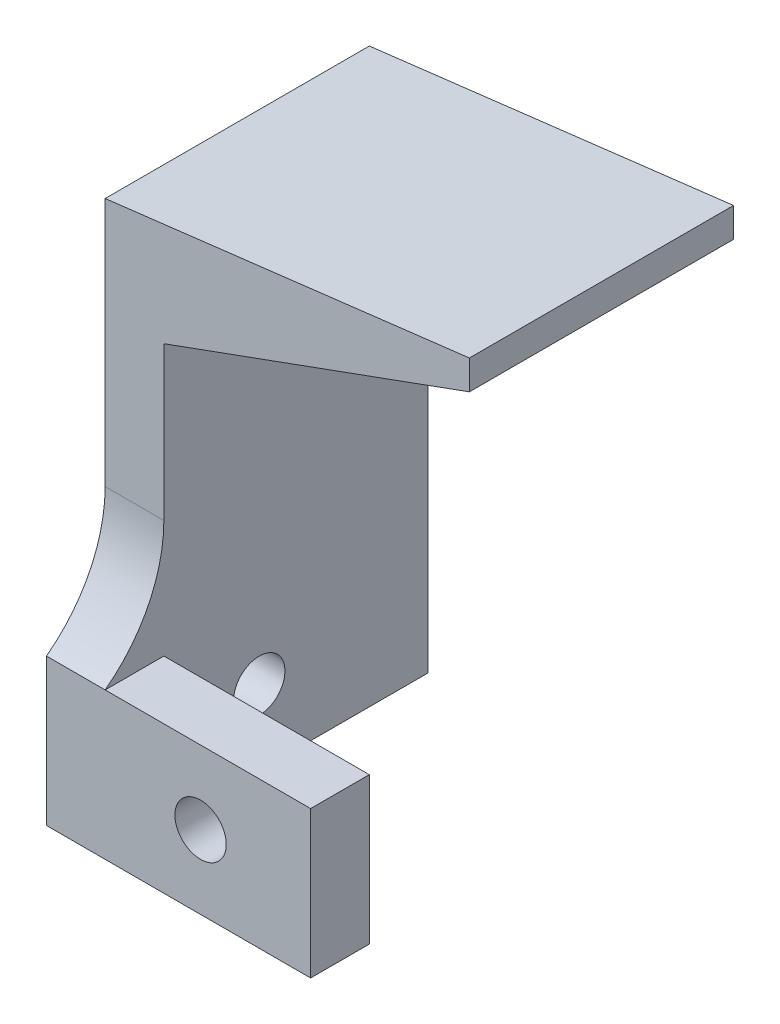
ISO-10303-21;
HEADER;
FILE_DESCRIPTION(('STEP AP214'),'2;1');
FILE_NAME('part.step','',(''),(''),'','','');
FILE_SCHEMA(('AUTOMOTIVE_DESIGN { 1 0 10303 214 1 1 1 1 }'));
ENDSEC;
DATA;
#1=APPLICATION_CONTEXT('core data for automotive mechanical design processes');
#2=APPLICATION_PROTOCOL_DEFINITION('international standard','automotive_design',2000,#1);
#3=PRODUCT_CONTEXT('',#1,'mechanical');
#4=PRODUCT('Part','Part','',(#3));
#5=PRODUCT_RELATED_PRODUCT_CATEGORY('part','',(#4));
#6=PRODUCT_DEFINITION_FORMATION('','',#4);
#7=PRODUCT_DEFINITION_CONTEXT('part definition',#1,'design');
#8=PRODUCT_DEFINITION('design','',#6,#7);
#9=PRODUCT_DEFINITION_SHAPE('','',#8);
#10=(LENGTH_UNIT() NAMED_UNIT(*) SI_UNIT(.MILLI.,.METRE.));
#11=(NAMED_UNIT(*) PLANE_ANGLE_UNIT() SI_UNIT($,.RADIAN.));
#12=(NAMED_UNIT(*) SI_UNIT($,.STERADIAN.) SOLID_ANGLE_UNIT());
#13=UNCERTAINTY_MEASURE_WITH_UNIT(LENGTH_MEASURE(1.E-05),#10,'distance_accuracy_value','');
#14=(GEOMETRIC_REPRESENTATION_CONTEXT(3) GLOBAL_UNCERTAINTY_ASSIGNED_CONTEXT((#13)) GLOBAL_UNIT_ASSIGNED_CONTEXT((#10,
#11,#12)) REPRESENTATION_CONTEXT('',''));
#15=CARTESIAN_POINT('',(0.,0.,0.));
#16=DIRECTION('',(0.,0.,1.));
#17=DIRECTION('',(1.,0.,0.));
#18=AXIS2_PLACEMENT_3D('',#15,#16,#17);
#19=CARTESIAN_POINT('',(0.,35.,18.));
#20=DIRECTION('',(1.,0.,0.));
#21=DIRECTION('',(0.,1.,0.));
#22=AXIS2_PLACEMENT_3D('',#19,#20,#21);
#23=PLANE('',#22);
#24=CARTESIAN_POINT('',(0.,5.,11.5));
#25=DIRECTION('',(-1.,0.,0.));
#26=DIRECTION('',(0.,-1.,0.));
#27=AXIS2_PLACEMENT_3D('',#24,#25,#26);
#28=CIRCLE('',#27,1.75);
#29=CARTESIAN_POINT('',(0.,3.25,11.5));
#30=VERTEX_POINT('',#29);
#31=EDGE_CURVE('E156',#30,#30,#28,.T.);
#32=ORIENTED_EDGE('',*,*,#31,.F.);
#33=EDGE_LOOP('',(#32));
#34=FACE_BOUND('',#33,.T.);
#35=DIRECTION('',(0.,-1.,0.));
#36=VECTOR('',#35,1.);
#37=CARTESIAN_POINT('',(0.,35.,0.));
#38=LINE('',#37,#36);
#39=CARTESIAN_POINT('',(0.,35.,0.));
#40=VERTEX_POINT('',#39);
#41=CARTESIAN_POINT('',(0.,0.,0.));
#42=VERTEX_POINT('',#41);
#43=EDGE_CURVE('E119',#40,#42,#38,.T.);
#44=ORIENTED_EDGE('',*,*,#43,.T.);
#45=DIRECTION('',(0.,0.,-1.));
#46=VECTOR('',#45,1.);
#47=CARTESIAN_POINT('',(0.,0.,18.));
#48=LINE('',#47,#46);
#49=CARTESIAN_POINT('',(0.,0.,22.));
#50=VERTEX_POINT('',#49);
#51=EDGE_CURVE('E113',#50,#42,#48,.T.);
#52=ORIENTED_EDGE('',*,*,#51,.F.);
#53=DIRECTION('',(0.,-1.,0.));
#54=VECTOR('',#53,1.);
#55=CARTESIAN_POINT('',(0.,0.,22.));
#56=LINE('',#55,#54);
#57=CARTESIAN_POINT('',(0.,10.,22.));
#58=VERTEX_POINT('',#57);
#59=EDGE_CURVE('E116',#58,#50,#56,.T.);
#60=ORIENTED_EDGE('',*,*,#59,.F.);
#61=CARTESIAN_POINT('',(0.,18.,28.));
#62=DIRECTION('',(1.,0.,0.));
#63=DIRECTION('',(0.,1.,0.));
#64=AXIS2_PLACEMENT_3D('',#61,#62,#63);
#65=CIRCLE('',#64,10.);
#66=CARTESIAN_POINT('',(0.,18.,18.));
#67=VERTEX_POINT('',#66);
#68=EDGE_CURVE('E42',#58,#67,#65,.T.);
#69=ORIENTED_EDGE('',*,*,#68,.T.);
#70=DIRECTION('',(0.,-1.,0.));
#71=VECTOR('',#70,1.);
#72=CARTESIAN_POINT('',(0.,35.,18.));
#73=LINE('',#72,#71);
#74=CARTESIAN_POINT('',(0.,35.,18.));
#75=VERTEX_POINT('',#74);
#76=EDGE_CURVE('E160',#75,#67,#73,.T.);
#77=ORIENTED_EDGE('',*,*,#76,.F.);
#78=DIRECTION('',(0.,0.,-1.));
#79=VECTOR('',#78,1.);
#80=CARTESIAN_POINT('',(0.,35.,18.));
#81=LINE('',#80,#79);
#82=EDGE_CURVE('E173',#75,#40,#81,.T.);
#83=ORIENTED_EDGE('',*,*,#82,.T.);
#84=EDGE_LOOP('',(#44,#52,#60,#69,#77,#83));
#85=FACE_BOUND('',#84,.T.);
#86=ADVANCED_FACE('F34',(#34,#85),#23,.F.);
#87=CARTESIAN_POINT('',(0.,0.,18.));
#88=DIRECTION('',(0.,1.,0.));
#89=DIRECTION('',(0.,0.,1.));
#90=AXIS2_PLACEMENT_3D('',#87,#88,#89);
#91=PLANE('',#90);
#92=DIRECTION('',(1.,0.,0.));
#93=VECTOR('',#92,1.);
#94=CARTESIAN_POINT('',(0.,0.,0.));
#95=LINE('',#94,#93);
#96=CARTESIAN_POINT('',(4.,0.,0.));
#97=VERTEX_POINT('',#96);
#98=EDGE_CURVE('E175',#42,#97,#95,.T.);
#99=ORIENTED_EDGE('',*,*,#98,.T.);
#100=DIRECTION('',(0.,0.,-1.));
#101=VECTOR('',#100,1.);
#102=CARTESIAN_POINT('',(4.,0.,18.));
#103=LINE('',#102,#101);
#104=CARTESIAN_POINT('',(4.,0.,18.));
#105=VERTEX_POINT('',#104);
#106=EDGE_CURVE('E121',#105,#97,#103,.T.);
#107=ORIENTED_EDGE('',*,*,#106,.F.);
#108=DIRECTION('',(1.,0.,0.));
#109=VECTOR('',#108,1.);
#110=CARTESIAN_POINT('',(0.,0.,18.));
#111=LINE('',#110,#109);
#112=CARTESIAN_POINT('',(18.,0.,18.));
#113=VERTEX_POINT('',#112);
#114=EDGE_CURVE('E149',#105,#113,#111,.T.);
#115=ORIENTED_EDGE('',*,*,#114,.T.);
#116=DIRECTION('',(0.,0.,-1.));
#117=VECTOR('',#116,1.);
#118=CARTESIAN_POINT('',(18.,0.,22.));
#119=LINE('',#118,#117);
#120=CARTESIAN_POINT('',(18.,0.,22.));
#121=VERTEX_POINT('',#120);
#122=EDGE_CURVE('E127',#121,#113,#119,.T.);
#123=ORIENTED_EDGE('',*,*,#122,.F.);
#124=DIRECTION('',(1.,0.,0.));
#125=VECTOR('',#124,1.);
#126=CARTESIAN_POINT('',(0.,0.,22.));
#127=LINE('',#126,#125);
#128=EDGE_CURVE('E124',#50,#121,#127,.T.);
#129=ORIENTED_EDGE('',*,*,#128,.F.);
#130=ORIENTED_EDGE('',*,*,#51,.T.);
#131=EDGE_LOOP('',(#99,#107,#115,#123,#129,#130));
#132=FACE_BOUND('',#131,.T.);
#133=ADVANCED_FACE('F125',(#132),#91,.F.);
#134=CARTESIAN_POINT('',(4.,0.,18.));
#135=DIRECTION('',(-1.,0.,0.));
#136=DIRECTION('',(0.,0.,1.));
#137=AXIS2_PLACEMENT_3D('',#134,#135,#136);
#138=PLANE('',#137);
#139=CARTESIAN_POINT('',(4.,5.,11.5));
#140=DIRECTION('',(-1.,0.,0.));
#141=DIRECTION('',(0.,0.,1.));
#142=AXIS2_PLACEMENT_3D('',#139,#140,#141);
#143=CIRCLE('',#142,1.75);
#144=CARTESIAN_POINT('',(4.,5.,13.25));
#145=VERTEX_POINT('',#144);
#146=EDGE_CURVE('E159',#145,#145,#143,.T.);
#147=ORIENTED_EDGE('',*,*,#146,.T.);
#148=EDGE_LOOP('',(#147));
#149=FACE_BOUND('',#148,.T.);
#150=DIRECTION('',(0.,1.,0.));
#151=VECTOR('',#150,1.);
#152=CARTESIAN_POINT('',(4.,0.,0.));
#153=LINE('',#152,#151);
#154=CARTESIAN_POINT('',(4.,28.4324251824066,0.));
#155=VERTEX_POINT('',#154);
#156=EDGE_CURVE('E177',#97,#155,#153,.T.);
#157=ORIENTED_EDGE('',*,*,#156,.T.);
#158=DIRECTION('',(0.,0.,-1.));
#159=VECTOR('',#158,1.);
#160=CARTESIAN_POINT('',(4.,28.4324251824066,18.));
#161=LINE('',#160,#159);
#162=CARTESIAN_POINT('',(4.,28.4324251824066,18.));
#163=VERTEX_POINT('',#162);
#164=EDGE_CURVE('E191',#163,#155,#161,.T.);
#165=ORIENTED_EDGE('',*,*,#164,.F.);
#166=DIRECTION('',(0.,1.,0.));
#167=VECTOR('',#166,1.);
#168=CARTESIAN_POINT('',(4.,0.,18.));
#169=LINE('',#168,#167);
#170=CARTESIAN_POINT('',(4.,18.,18.));
#171=VERTEX_POINT('',#170);
#172=EDGE_CURVE('E162',#171,#163,#169,.T.);
#173=ORIENTED_EDGE('',*,*,#172,.F.);
#174=CARTESIAN_POINT('',(4.,18.,28.));
#175=DIRECTION('',(-1.,0.,0.));
#176=DIRECTION('',(0.,0.,1.));
#177=AXIS2_PLACEMENT_3D('',#174,#175,#176);
#178=CIRCLE('',#177,10.);
#179=CARTESIAN_POINT('',(4.,10.,22.));
#180=VERTEX_POINT('',#179);
#181=EDGE_CURVE('E11',#171,#180,#178,.T.);
#182=ORIENTED_EDGE('',*,*,#181,.T.);
#183=DIRECTION('',(0.,0.,1.));
#184=VECTOR('',#183,1.);
#185=CARTESIAN_POINT('',(4.,10.,18.));
#186=LINE('',#185,#184);
#187=CARTESIAN_POINT('',(4.,10.,18.));
#188=VERTEX_POINT('',#187);
#189=EDGE_CURVE('E48',#188,#180,#186,.T.);
#190=ORIENTED_EDGE('',*,*,#189,.F.);
#191=EDGE_CURVE('E164',#105,#188,#169,.T.);
#192=ORIENTED_EDGE('',*,*,#191,.F.);
#193=ORIENTED_EDGE('',*,*,#106,.T.);
#194=EDGE_LOOP('',(#157,#165,#173,#182,#190,#192,#193));
#195=FACE_BOUND('',#194,.T.);
#196=ADVANCED_FACE('F207',(#149,#195),#138,.F.);
#197=CARTESIAN_POINT('',(4.,28.4324251824066,18.));
#198=DIRECTION('',(-0.341581671118433,0.939852095787384,0.));
#199=DIRECTION('',(-0.939852095787384,-0.341581671118433,0.));
#200=AXIS2_PLACEMENT_3D('',#197,#198,#199);
#201=PLANE('',#200);
#202=DIRECTION('',(0.939852095787384,0.341581671118433,0.));
#203=VECTOR('',#202,1.);
#204=CARTESIAN_POINT('',(4.,28.4324251824066,0.));
#205=LINE('',#204,#203);
#206=CARTESIAN_POINT('',(24.8194573660672,35.9990892040709,0.));
#207=VERTEX_POINT('',#206);
#208=EDGE_CURVE('E179',#155,#207,#205,.T.);
#209=ORIENTED_EDGE('',*,*,#208,.T.);
#210=DIRECTION('',(0.,0.,-1.));
#211=VECTOR('',#210,1.);
#212=CARTESIAN_POINT('',(24.8194573660672,35.9990892040709,18.));
#213=LINE('',#212,#211);
#214=CARTESIAN_POINT('',(24.8194573660672,35.9990892040709,18.));
#215=VERTEX_POINT('',#214);
#216=EDGE_CURVE('E188',#215,#207,#213,.T.);
#217=ORIENTED_EDGE('',*,*,#216,.F.);
#218=DIRECTION('',(0.939852095787384,0.341581671118433,0.));
#219=VECTOR('',#218,1.);
#220=CARTESIAN_POINT('',(4.,28.4324251824066,18.));
#221=LINE('',#220,#219);
#222=EDGE_CURVE('E167',#163,#215,#221,.T.);
#223=ORIENTED_EDGE('',*,*,#222,.F.);
#224=ORIENTED_EDGE('',*,*,#164,.T.);
#225=EDGE_LOOP('',(#209,#217,#223,#224));
#226=FACE_BOUND('',#225,.T.);
#227=ADVANCED_FACE('F227',(#226),#201,.F.);
#228=CARTESIAN_POINT('',(24.8194573660672,35.9990892040709,18.));
#229=DIRECTION('',(-1.,0.,0.));
#230=DIRECTION('',(0.,-1.,0.));
#231=AXIS2_PLACEMENT_3D('',#228,#229,#230);
#232=PLANE('',#231);
#233=DIRECTION('',(0.,1.,0.));
#234=VECTOR('',#233,1.);
#235=CARTESIAN_POINT('',(24.8194573660672,35.9990892040709,0.));
#236=LINE('',#235,#234);
#237=CARTESIAN_POINT('',(24.8194573660672,37.9990892040709,0.));
#238=VERTEX_POINT('',#237);
#239=EDGE_CURVE('E181',#207,#238,#236,.T.);
#240=ORIENTED_EDGE('',*,*,#239,.T.);
#241=DIRECTION('',(0.,0.,-1.));
#242=VECTOR('',#241,1.);
#243=CARTESIAN_POINT('',(24.8194573660672,37.9990892040709,18.));
#244=LINE('',#243,#242);
#245=CARTESIAN_POINT('',(24.8194573660672,37.9990892040709,18.));
#246=VERTEX_POINT('',#245);
#247=EDGE_CURVE('E185',#246,#238,#244,.T.);
#248=ORIENTED_EDGE('',*,*,#247,.F.);
#249=DIRECTION('',(0.,1.,0.));
#250=VECTOR('',#249,1.);
#251=CARTESIAN_POINT('',(24.8194573660672,35.9990892040709,18.));
#252=LINE('',#251,#250);
#253=EDGE_CURVE('E169',#215,#246,#252,.T.);
#254=ORIENTED_EDGE('',*,*,#253,.F.);
#255=ORIENTED_EDGE('',*,*,#216,.T.);
#256=EDGE_LOOP('',(#240,#248,#254,#255));
#257=FACE_BOUND('',#256,.T.);
#258=ADVANCED_FACE('F231',(#257),#232,.F.);
#259=CARTESIAN_POINT('',(24.8194573660672,37.9990892040709,18.));
#260=DIRECTION('',(0.119963568162835,-0.992778294642686,0.));
#261=DIRECTION('',(0.992778294642687,0.119963568162835,0.));
#262=AXIS2_PLACEMENT_3D('',#259,#260,#261);
#263=PLANE('',#262);
#264=DIRECTION('',(-0.992778294642687,-0.119963568162835,0.));
#265=VECTOR('',#264,1.);
#266=CARTESIAN_POINT('',(24.8194573660672,37.9990892040709,0.));
#267=LINE('',#266,#265);
#268=EDGE_CURVE('E163',#238,#40,#267,.T.);
#269=ORIENTED_EDGE('',*,*,#268,.T.);
#270=ORIENTED_EDGE('',*,*,#82,.F.);
#271=DIRECTION('',(-0.992778294642687,-0.119963568162835,0.));
#272=VECTOR('',#271,1.);
#273=CARTESIAN_POINT('',(24.8194573660672,37.9990892040709,18.));
#274=LINE('',#273,#272);
#275=EDGE_CURVE('E171',#246,#75,#274,.T.);
#276=ORIENTED_EDGE('',*,*,#275,.F.);
#277=ORIENTED_EDGE('',*,*,#247,.T.);
#278=EDGE_LOOP('',(#269,#270,#276,#277));
#279=FACE_BOUND('',#278,.T.);
#280=ADVANCED_FACE('F235',(#279),#263,.F.);
#281=CARTESIAN_POINT('',(0.,0.,18.));
#282=DIRECTION('',(0.,0.,1.));
#283=DIRECTION('',(1.,0.,0.));
#284=AXIS2_PLACEMENT_3D('',#281,#282,#283);
#285=PLANE('',#284);
#286=ORIENTED_EDGE('',*,*,#76,.T.);
#287=DIRECTION('',(-1.,0.,0.));
#288=VECTOR('',#287,1.);
#289=CARTESIAN_POINT('',(4.,18.,18.));
#290=LINE('',#289,#288);
#291=EDGE_CURVE('E199',#67,#171,#290,.F.);
#292=ORIENTED_EDGE('',*,*,#291,.T.);
#293=ORIENTED_EDGE('',*,*,#172,.T.);
#294=ORIENTED_EDGE('',*,*,#222,.T.);
#295=ORIENTED_EDGE('',*,*,#253,.T.);
#296=ORIENTED_EDGE('',*,*,#275,.T.);
#297=EDGE_LOOP('',(#286,#292,#293,#294,#295,#296));
#298=FACE_BOUND('',#297,.T.);
#299=ADVANCED_FACE('F203',(#298),#285,.T.);
#300=CARTESIAN_POINT('',(0.,0.,0.));
#301=DIRECTION('',(0.,0.,1.));
#302=DIRECTION('',(1.,0.,0.));
#303=AXIS2_PLACEMENT_3D('',#300,#301,#302);
#304=PLANE('',#303);
#305=ORIENTED_EDGE('',*,*,#43,.F.);
#306=ORIENTED_EDGE('',*,*,#268,.F.);
#307=ORIENTED_EDGE('',*,*,#239,.F.);
#308=ORIENTED_EDGE('',*,*,#208,.F.);
#309=ORIENTED_EDGE('',*,*,#156,.F.);
#310=ORIENTED_EDGE('',*,*,#98,.F.);
#311=EDGE_LOOP('',(#305,#306,#307,#308,#309,#310));
#312=FACE_BOUND('',#311,.T.);
#313=ADVANCED_FACE('F240',(#312),#304,.F.);
#314=CARTESIAN_POINT('',(13.,5.,11.5));
#315=DIRECTION('',(-1.,0.,0.));
#316=DIRECTION('',(0.,-1.,0.));
#317=AXIS2_PLACEMENT_3D('',#314,#315,#316);
#318=CYLINDRICAL_SURFACE('',#317,1.75);
#319=ORIENTED_EDGE('',*,*,#31,.T.);
#320=EDGE_LOOP('',(#319));
#321=FACE_BOUND('',#320,.T.);
#322=ORIENTED_EDGE('',*,*,#146,.F.);
#323=EDGE_LOOP('',(#322));
#324=FACE_BOUND('',#323,.T.);
#325=ADVANCED_FACE('F243',(#321,#324),#318,.F.);
#326=CARTESIAN_POINT('',(18.,0.,22.));
#327=DIRECTION('',(-1.,0.,0.));
#328=DIRECTION('',(0.,-1.,0.));
#329=AXIS2_PLACEMENT_3D('',#326,#327,#328);
#330=PLANE('',#329);
#331=DIRECTION('',(0.,1.,0.));
#332=VECTOR('',#331,1.);
#333=CARTESIAN_POINT('',(18.,0.,18.));
#334=LINE('',#333,#332);
#335=CARTESIAN_POINT('',(18.,10.,18.));
#336=VERTEX_POINT('',#335);
#337=EDGE_CURVE('E139',#113,#336,#334,.T.);
#338=ORIENTED_EDGE('',*,*,#337,.T.);
#339=DIRECTION('',(0.,0.,-1.));
#340=VECTOR('',#339,1.);
#341=CARTESIAN_POINT('',(18.,10.,22.));
#342=LINE('',#341,#340);
#343=CARTESIAN_POINT('',(18.,10.,22.));
#344=VERTEX_POINT('',#343);
#345=EDGE_CURVE('E148',#344,#336,#342,.T.);
#346=ORIENTED_EDGE('',*,*,#345,.F.);
#347=DIRECTION('',(0.,1.,0.));
#348=VECTOR('',#347,1.);
#349=CARTESIAN_POINT('',(18.,0.,22.));
#350=LINE('',#349,#348);
#351=EDGE_CURVE('E130',#121,#344,#350,.T.);
#352=ORIENTED_EDGE('',*,*,#351,.F.);
#353=ORIENTED_EDGE('',*,*,#122,.T.);
#354=EDGE_LOOP('',(#338,#346,#352,#353));
#355=FACE_BOUND('',#354,.T.);
#356=ADVANCED_FACE('F249',(#355),#330,.F.);
#357=CARTESIAN_POINT('',(0.,10.,22.));
#358=DIRECTION('',(0.,-1.,0.));
#359=DIRECTION('',(0.,0.,-1.));
#360=AXIS2_PLACEMENT_3D('',#357,#358,#359);
#361=PLANE('',#360);
#362=DIRECTION('',(-1.,0.,0.));
#363=VECTOR('',#362,1.);
#364=CARTESIAN_POINT('',(0.,10.,18.));
#365=LINE('',#364,#363);
#366=EDGE_CURVE('E137',#336,#188,#365,.T.);
#367=ORIENTED_EDGE('',*,*,#366,.T.);
#368=ORIENTED_EDGE('',*,*,#189,.T.);
#369=DIRECTION('',(-1.,0.,0.));
#370=VECTOR('',#369,1.);
#371=CARTESIAN_POINT('',(0.,10.,22.));
#372=LINE('',#371,#370);
#373=EDGE_CURVE('E146',#344,#180,#372,.T.);
#374=ORIENTED_EDGE('',*,*,#373,.F.);
#375=ORIENTED_EDGE('',*,*,#345,.T.);
#376=EDGE_LOOP('',(#367,#368,#374,#375));
#377=FACE_BOUND('',#376,.T.);
#378=ADVANCED_FACE('F253',(#377),#361,.F.);
#379=CARTESIAN_POINT('',(0.,0.,22.));
#380=DIRECTION('',(0.,0.,-1.));
#381=DIRECTION('',(-1.,0.,0.));
#382=AXIS2_PLACEMENT_3D('',#379,#380,#381);
#383=PLANE('',#382);
#384=CARTESIAN_POINT('',(10.5,5.,22.));
#385=DIRECTION('',(0.,0.,-1.));
#386=DIRECTION('',(-1.,0.,0.));
#387=AXIS2_PLACEMENT_3D('',#384,#385,#386);
#388=CIRCLE('',#387,1.75);
#389=CARTESIAN_POINT('',(8.75,5.,22.));
#390=VERTEX_POINT('',#389);
#391=EDGE_CURVE('E151',#390,#390,#388,.T.);
#392=ORIENTED_EDGE('',*,*,#391,.T.);
#393=EDGE_LOOP('',(#392));
#394=FACE_BOUND('',#393,.T.);
#395=ORIENTED_EDGE('',*,*,#59,.T.);
#396=ORIENTED_EDGE('',*,*,#128,.T.);
#397=ORIENTED_EDGE('',*,*,#351,.T.);
#398=ORIENTED_EDGE('',*,*,#373,.T.);
#399=EDGE_CURVE('E136',#180,#58,#372,.T.);
#400=ORIENTED_EDGE('',*,*,#399,.T.);
#401=EDGE_LOOP('',(#395,#396,#397,#398,#400));
#402=FACE_BOUND('',#401,.T.);
#403=ADVANCED_FACE('F133',(#394,#402),#383,.F.);
#404=CARTESIAN_POINT('',(0.,0.,18.));
#405=DIRECTION('',(0.,0.,-1.));
#406=DIRECTION('',(-1.,0.,0.));
#407=AXIS2_PLACEMENT_3D('',#404,#405,#406);
#408=PLANE('',#407);
#409=CARTESIAN_POINT('',(10.5,5.,18.));
#410=DIRECTION('',(0.,0.,-1.));
#411=DIRECTION('',(-1.,0.,0.));
#412=AXIS2_PLACEMENT_3D('',#409,#410,#411);
#413=CIRCLE('',#412,1.75);
#414=CARTESIAN_POINT('',(8.75,5.,18.));
#415=VERTEX_POINT('',#414);
#416=EDGE_CURVE('E142',#415,#415,#413,.T.);
#417=ORIENTED_EDGE('',*,*,#416,.F.);
#418=EDGE_LOOP('',(#417));
#419=FACE_BOUND('',#418,.T.);
#420=ORIENTED_EDGE('',*,*,#114,.F.);
#421=ORIENTED_EDGE('',*,*,#191,.T.);
#422=ORIENTED_EDGE('',*,*,#366,.F.);
#423=ORIENTED_EDGE('',*,*,#337,.F.);
#424=EDGE_LOOP('',(#420,#421,#422,#423));
#425=FACE_BOUND('',#424,.T.);
#426=ADVANCED_FACE('F214',(#419,#425),#408,.T.);
#427=CARTESIAN_POINT('',(10.5,5.,22.));
#428=DIRECTION('',(0.,0.,-1.));
#429=DIRECTION('',(-1.,0.,0.));
#430=AXIS2_PLACEMENT_3D('',#427,#428,#429);
#431=CYLINDRICAL_SURFACE('',#430,1.75);
#432=ORIENTED_EDGE('',*,*,#391,.F.);
#433=EDGE_LOOP('',(#432));
#434=FACE_BOUND('',#433,.T.);
#435=ORIENTED_EDGE('',*,*,#416,.T.);
#436=EDGE_LOOP('',(#435));
#437=FACE_BOUND('',#436,.T.);
#438=ADVANCED_FACE('F210',(#434,#437),#431,.F.);
#439=CARTESIAN_POINT('',(0.,18.,28.));
#440=DIRECTION('',(1.,0.,0.));
#441=DIRECTION('',(0.,0.,-1.));
#442=AXIS2_PLACEMENT_3D('',#439,#440,#441);
#443=CYLINDRICAL_SURFACE('',#442,10.);
#444=ORIENTED_EDGE('',*,*,#181,.F.);
#445=ORIENTED_EDGE('',*,*,#291,.F.);
#446=ORIENTED_EDGE('',*,*,#68,.F.);
#447=ORIENTED_EDGE('',*,*,#399,.F.);
#448=EDGE_LOOP('',(#444,#445,#446,#447));
#449=FACE_BOUND('',#448,.T.);
#450=ADVANCED_FACE('F36',(#449),#443,.F.);
#451=CLOSED_SHELL('',(#86,#133,#196,#227,#258,#280,#299,#313,#325,#356,#378,#403,#426,#438,#450));
#452=MANIFOLD_SOLID_BREP('B2',#451);
#453=ADVANCED_BREP_SHAPE_REPRESENTATION('',(#18,#452),#14);
#454=SHAPE_DEFINITION_REPRESENTATION(#9,#453);
ENDSEC;
END-ISO-10303-21;
